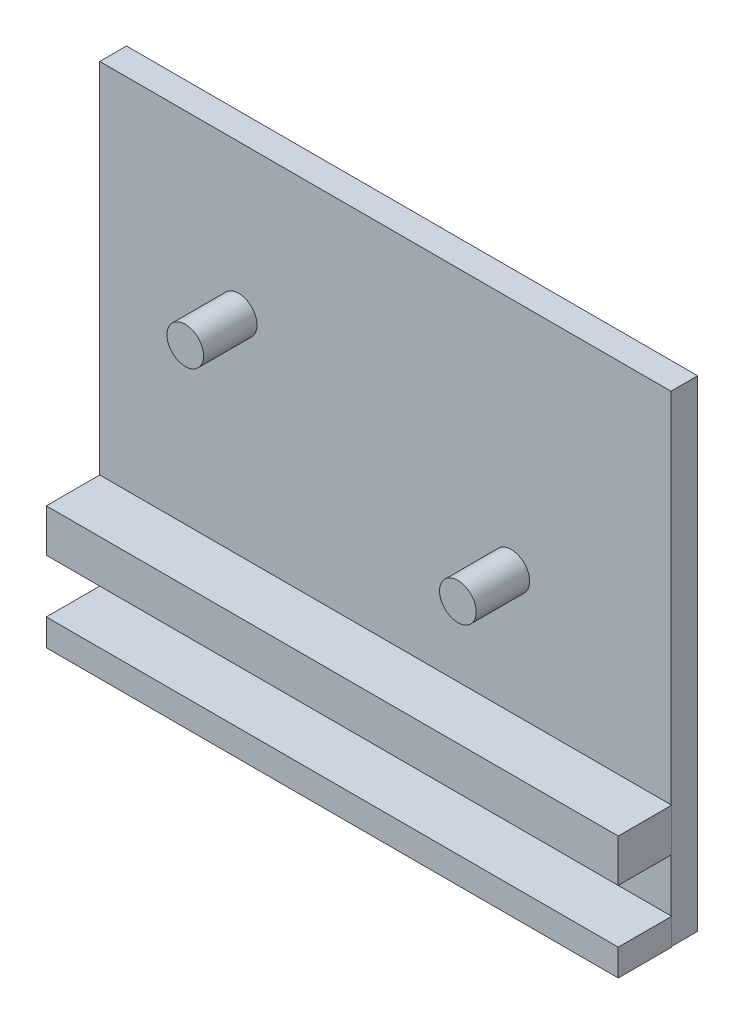
ISO-10303-21;
HEADER;
FILE_DESCRIPTION(('STEP AP214'),'2;1');
FILE_NAME('part.step','',(''),(''),'','','');
FILE_SCHEMA(('AUTOMOTIVE_DESIGN { 1 0 10303 214 1 1 1 1 }'));
ENDSEC;
DATA;
#1=APPLICATION_CONTEXT('core data for automotive mechanical design processes');
#2=APPLICATION_PROTOCOL_DEFINITION('international standard','automotive_design',2000,#1);
#3=PRODUCT_CONTEXT('',#1,'mechanical');
#4=PRODUCT('Part','Part','',(#3));
#5=PRODUCT_RELATED_PRODUCT_CATEGORY('part','',(#4));
#6=PRODUCT_DEFINITION_FORMATION('','',#4);
#7=PRODUCT_DEFINITION_CONTEXT('part definition',#1,'design');
#8=PRODUCT_DEFINITION('design','',#6,#7);
#9=PRODUCT_DEFINITION_SHAPE('','',#8);
#10=(LENGTH_UNIT() NAMED_UNIT(*) SI_UNIT(.MILLI.,.METRE.));
#11=(NAMED_UNIT(*) PLANE_ANGLE_UNIT() SI_UNIT($,.RADIAN.));
#12=(NAMED_UNIT(*) SI_UNIT($,.STERADIAN.) SOLID_ANGLE_UNIT());
#13=UNCERTAINTY_MEASURE_WITH_UNIT(LENGTH_MEASURE(1.E-05),#10,'distance_accuracy_value','');
#14=(GEOMETRIC_REPRESENTATION_CONTEXT(3) GLOBAL_UNCERTAINTY_ASSIGNED_CONTEXT((#13)) GLOBAL_UNIT_ASSIGNED_CONTEXT((#10,
#11,#12)) REPRESENTATION_CONTEXT('',''));
#15=CARTESIAN_POINT('',(0.,0.,0.));
#16=DIRECTION('',(0.,0.,1.));
#17=DIRECTION('',(1.,0.,0.));
#18=AXIS2_PLACEMENT_3D('',#15,#16,#17);
#19=CARTESIAN_POINT('',(0.,0.,0.));
#20=DIRECTION('',(0.,0.,-1.));
#21=DIRECTION('',(-1.,0.,0.));
#22=AXIS2_PLACEMENT_3D('',#19,#20,#21);
#23=PLANE('',#22);
#24=DIRECTION('',(1.,0.,0.));
#25=VECTOR('',#24,1.);
#26=CARTESIAN_POINT('',(-53.5,-38.,0.));
#27=LINE('',#26,#25);
#28=CARTESIAN_POINT('',(-53.5,-38.,0.));
#29=VERTEX_POINT('',#28);
#30=CARTESIAN_POINT('',(53.3667548614009,-38.,0.));
#31=VERTEX_POINT('',#30);
#32=EDGE_CURVE('E54',#29,#31,#27,.T.);
#33=ORIENTED_EDGE('',*,*,#32,.F.);
#34=DIRECTION('',(0.,1.,0.));
#35=VECTOR('',#34,1.);
#36=CARTESIAN_POINT('',(-53.5,37.,0.));
#37=LINE('',#36,#35);
#38=CARTESIAN_POINT('',(-53.5,-48.,0.));
#39=VERTEX_POINT('',#38);
#40=EDGE_CURVE('E154',#39,#29,#37,.T.);
#41=ORIENTED_EDGE('',*,*,#40,.F.);
#42=DIRECTION('',(-1.,0.,0.));
#43=VECTOR('',#42,1.);
#44=CARTESIAN_POINT('',(0.,-48.,0.));
#45=LINE('',#44,#43);
#46=CARTESIAN_POINT('',(53.3667548614009,-48.,0.));
#47=VERTEX_POINT('',#46);
#48=EDGE_CURVE('E11',#47,#39,#45,.T.);
#49=ORIENTED_EDGE('',*,*,#48,.F.);
#50=DIRECTION('',(0.,-1.,0.));
#51=VECTOR('',#50,1.);
#52=CARTESIAN_POINT('',(53.3667548614009,37.,0.));
#53=LINE('',#52,#51);
#54=EDGE_CURVE('E62',#31,#47,#53,.T.);
#55=ORIENTED_EDGE('',*,*,#54,.F.);
#56=EDGE_LOOP('',(#33,#41,#49,#55));
#57=FACE_BOUND('',#56,.T.);
#58=ADVANCED_FACE('F39',(#57),#23,.F.);
#59=CARTESIAN_POINT('',(23.5,-7.00000000000001,0.));
#60=DIRECTION('',(0.,0.,-1.));
#61=DIRECTION('',(-1.,0.,0.));
#62=AXIS2_PLACEMENT_3D('',#59,#60,#61);
#63=CIRCLE('',#62,3.42413986926529);
#64=CARTESIAN_POINT('',(20.0758601307347,-7.00000000000001,0.));
#65=VERTEX_POINT('',#64);
#66=EDGE_CURVE('E47',#65,#65,#63,.F.);
#67=ORIENTED_EDGE('',*,*,#66,.F.);
#68=EDGE_LOOP('',(#67));
#69=FACE_BOUND('',#68,.T.);
#70=CARTESIAN_POINT('',(-27.5,8.99999999999999,0.));
#71=DIRECTION('',(0.,0.,1.));
#72=DIRECTION('',(1.,0.,0.));
#73=AXIS2_PLACEMENT_3D('',#70,#71,#72);
#74=CIRCLE('',#73,3.42413986926528);
#75=CARTESIAN_POINT('',(-24.0758601307347,8.99999999999999,0.));
#76=VERTEX_POINT('',#75);
#77=EDGE_CURVE('E216',#76,#76,#74,.T.);
#78=ORIENTED_EDGE('',*,*,#77,.F.);
#79=EDGE_LOOP('',(#78));
#80=FACE_BOUND('',#79,.T.);
#81=DIRECTION('',(-1.,0.,0.));
#82=VECTOR('',#81,1.);
#83=CARTESIAN_POINT('',(-53.5,-30.,0.));
#84=LINE('',#83,#82);
#85=CARTESIAN_POINT('',(53.3667548614009,-30.,0.));
#86=VERTEX_POINT('',#85);
#87=CARTESIAN_POINT('',(-53.5,-30.,0.));
#88=VERTEX_POINT('',#87);
#89=EDGE_CURVE('E235',#86,#88,#84,.T.);
#90=ORIENTED_EDGE('',*,*,#89,.F.);
#91=CARTESIAN_POINT('',(53.3667548614009,37.,0.));
#92=VERTEX_POINT('',#91);
#93=EDGE_CURVE('E192',#92,#86,#53,.T.);
#94=ORIENTED_EDGE('',*,*,#93,.F.);
#95=DIRECTION('',(1.,0.,0.));
#96=VECTOR('',#95,1.);
#97=CARTESIAN_POINT('',(53.3667548614009,37.,0.));
#98=LINE('',#97,#96);
#99=CARTESIAN_POINT('',(-53.5,37.,0.));
#100=VERTEX_POINT('',#99);
#101=EDGE_CURVE('E200',#100,#92,#98,.T.);
#102=ORIENTED_EDGE('',*,*,#101,.F.);
#103=EDGE_CURVE('E187',#88,#100,#37,.T.);
#104=ORIENTED_EDGE('',*,*,#103,.F.);
#105=EDGE_LOOP('',(#90,#94,#102,#104));
#106=FACE_BOUND('',#105,.T.);
#107=ADVANCED_FACE('F226',(#69,#80,#106),#23,.F.);
#108=CARTESIAN_POINT('',(-27.5,8.99999999999999,10.));
#109=DIRECTION('',(0.,0.,-1.));
#110=DIRECTION('',(-1.,0.,0.));
#111=AXIS2_PLACEMENT_3D('',#108,#109,#110);
#112=CYLINDRICAL_SURFACE('',#111,3.42413986926528);
#113=CARTESIAN_POINT('',(-27.5,8.99999999999999,10.));
#114=DIRECTION('',(0.,0.,1.));
#115=DIRECTION('',(1.,0.,0.));
#116=AXIS2_PLACEMENT_3D('',#113,#114,#115);
#117=CIRCLE('',#116,3.42413986926528);
#118=CARTESIAN_POINT('',(-24.0758601307347,8.99999999999999,10.));
#119=VERTEX_POINT('',#118);
#120=EDGE_CURVE('E217',#119,#119,#117,.T.);
#121=ORIENTED_EDGE('',*,*,#120,.F.);
#122=EDGE_LOOP('',(#121));
#123=FACE_BOUND('',#122,.T.);
#124=ORIENTED_EDGE('',*,*,#77,.T.);
#125=EDGE_LOOP('',(#124));
#126=FACE_BOUND('',#125,.T.);
#127=ADVANCED_FACE('F41',(#123,#126),#112,.T.);
#128=CARTESIAN_POINT('',(-27.5,8.99999999999999,10.));
#129=DIRECTION('',(0.,0.,1.));
#130=DIRECTION('',(1.,0.,0.));
#131=AXIS2_PLACEMENT_3D('',#128,#129,#130);
#132=PLANE('',#131);
#133=ORIENTED_EDGE('',*,*,#120,.T.);
#134=EDGE_LOOP('',(#133));
#135=FACE_BOUND('',#134,.T.);
#136=ADVANCED_FACE('F289',(#135),#132,.T.);
#137=CARTESIAN_POINT('',(-53.5,37.,-5.));
#138=DIRECTION('',(1.,0.,0.));
#139=DIRECTION('',(0.,1.,0.));
#140=AXIS2_PLACEMENT_3D('',#137,#138,#139);
#141=PLANE('',#140);
#142=DIRECTION('',(0.,0.,1.));
#143=VECTOR('',#142,1.);
#144=CARTESIAN_POINT('',(-53.5,-53.,-5.));
#145=LINE('',#144,#143);
#146=CARTESIAN_POINT('',(-53.5,-53.,-5.));
#147=VERTEX_POINT('',#146);
#148=CARTESIAN_POINT('',(-53.5,-53.,10.));
#149=VERTEX_POINT('',#148);
#150=EDGE_CURVE('E198',#147,#149,#145,.T.);
#151=ORIENTED_EDGE('',*,*,#150,.T.);
#152=DIRECTION('',(0.,-1.,0.));
#153=VECTOR('',#152,1.);
#154=CARTESIAN_POINT('',(-53.5,-53.,10.));
#155=LINE('',#154,#153);
#156=CARTESIAN_POINT('',(-53.5,-48.,10.));
#157=VERTEX_POINT('',#156);
#158=EDGE_CURVE('E163',#157,#149,#155,.T.);
#159=ORIENTED_EDGE('',*,*,#158,.F.);
#160=DIRECTION('',(0.,0.,-1.));
#161=VECTOR('',#160,1.);
#162=CARTESIAN_POINT('',(-53.5,-48.,10.));
#163=LINE('',#162,#161);
#164=EDGE_CURVE('E172',#157,#39,#163,.T.);
#165=ORIENTED_EDGE('',*,*,#164,.T.);
#166=ORIENTED_EDGE('',*,*,#40,.T.);
#167=DIRECTION('',(0.,0.,-1.));
#168=VECTOR('',#167,1.);
#169=CARTESIAN_POINT('',(-53.5,-38.,10.));
#170=LINE('',#169,#168);
#171=CARTESIAN_POINT('',(-53.5,-38.,10.));
#172=VERTEX_POINT('',#171);
#173=EDGE_CURVE('E134',#172,#29,#170,.T.);
#174=ORIENTED_EDGE('',*,*,#173,.F.);
#175=DIRECTION('',(0.,-1.,0.));
#176=VECTOR('',#175,1.);
#177=CARTESIAN_POINT('',(-53.5,-30.,10.));
#178=LINE('',#177,#176);
#179=CARTESIAN_POINT('',(-53.5,-30.,10.));
#180=VERTEX_POINT('',#179);
#181=EDGE_CURVE('E140',#180,#172,#178,.T.);
#182=ORIENTED_EDGE('',*,*,#181,.F.);
#183=DIRECTION('',(0.,0.,-1.));
#184=VECTOR('',#183,1.);
#185=CARTESIAN_POINT('',(-53.5,-30.,10.));
#186=LINE('',#185,#184);
#187=EDGE_CURVE('E249',#180,#88,#186,.T.);
#188=ORIENTED_EDGE('',*,*,#187,.T.);
#189=ORIENTED_EDGE('',*,*,#103,.T.);
#190=DIRECTION('',(0.,0.,1.));
#191=VECTOR('',#190,1.);
#192=CARTESIAN_POINT('',(-53.5,37.,-5.));
#193=LINE('',#192,#191);
#194=CARTESIAN_POINT('',(-53.5,37.,-5.));
#195=VERTEX_POINT('',#194);
#196=EDGE_CURVE('E213',#195,#100,#193,.T.);
#197=ORIENTED_EDGE('',*,*,#196,.F.);
#198=DIRECTION('',(0.,1.,0.));
#199=VECTOR('',#198,1.);
#200=CARTESIAN_POINT('',(-53.5,37.,-5.));
#201=LINE('',#200,#199);
#202=EDGE_CURVE('E188',#147,#195,#201,.T.);
#203=ORIENTED_EDGE('',*,*,#202,.F.);
#204=EDGE_LOOP('',(#151,#159,#165,#166,#174,#182,#188,#189,#197,#203));
#205=FACE_BOUND('',#204,.T.);
#206=ADVANCED_FACE('F152',(#205),#141,.F.);
#207=CARTESIAN_POINT('',(53.3667548614009,37.,-5.));
#208=DIRECTION('',(0.,-1.,0.));
#209=DIRECTION('',(0.,0.,-1.));
#210=AXIS2_PLACEMENT_3D('',#207,#208,#209);
#211=PLANE('',#210);
#212=ORIENTED_EDGE('',*,*,#101,.T.);
#213=DIRECTION('',(0.,0.,1.));
#214=VECTOR('',#213,1.);
#215=CARTESIAN_POINT('',(53.3667548614009,37.,-5.));
#216=LINE('',#215,#214);
#217=CARTESIAN_POINT('',(53.3667548614009,37.,-5.));
#218=VERTEX_POINT('',#217);
#219=EDGE_CURVE('E210',#218,#92,#216,.T.);
#220=ORIENTED_EDGE('',*,*,#219,.F.);
#221=DIRECTION('',(1.,0.,0.));
#222=VECTOR('',#221,1.);
#223=CARTESIAN_POINT('',(53.3667548614009,37.,-5.));
#224=LINE('',#223,#222);
#225=EDGE_CURVE('E191',#195,#218,#224,.T.);
#226=ORIENTED_EDGE('',*,*,#225,.F.);
#227=ORIENTED_EDGE('',*,*,#196,.T.);
#228=EDGE_LOOP('',(#212,#220,#226,#227));
#229=FACE_BOUND('',#228,.T.);
#230=ADVANCED_FACE('F246',(#229),#211,.F.);
#231=CARTESIAN_POINT('',(53.3667548614009,37.,-5.));
#232=DIRECTION('',(-1.,0.,0.));
#233=DIRECTION('',(0.,-1.,0.));
#234=AXIS2_PLACEMENT_3D('',#231,#232,#233);
#235=PLANE('',#234);
#236=ORIENTED_EDGE('',*,*,#93,.T.);
#237=EDGE_CURVE('E205',#86,#31,#53,.T.);
#238=ORIENTED_EDGE('',*,*,#237,.T.);
#239=ORIENTED_EDGE('',*,*,#54,.T.);
#240=CARTESIAN_POINT('',(53.3667548614009,-53.,0.));
#241=VERTEX_POINT('',#240);
#242=EDGE_CURVE('E202',#47,#241,#53,.T.);
#243=ORIENTED_EDGE('',*,*,#242,.T.);
#244=DIRECTION('',(0.,0.,1.));
#245=VECTOR('',#244,1.);
#246=CARTESIAN_POINT('',(53.3667548614009,-53.,-5.));
#247=LINE('',#246,#245);
#248=CARTESIAN_POINT('',(53.3667548614009,-53.,-5.));
#249=VERTEX_POINT('',#248);
#250=EDGE_CURVE('E207',#249,#241,#247,.T.);
#251=ORIENTED_EDGE('',*,*,#250,.F.);
#252=DIRECTION('',(0.,-1.,0.));
#253=VECTOR('',#252,1.);
#254=CARTESIAN_POINT('',(53.3667548614009,37.,-5.));
#255=LINE('',#254,#253);
#256=EDGE_CURVE('E194',#218,#249,#255,.T.);
#257=ORIENTED_EDGE('',*,*,#256,.F.);
#258=ORIENTED_EDGE('',*,*,#219,.T.);
#259=EDGE_LOOP('',(#236,#238,#239,#243,#251,#257,#258));
#260=FACE_BOUND('',#259,.T.);
#261=ADVANCED_FACE('F241',(#260),#235,.F.);
#262=CARTESIAN_POINT('',(53.3667548614009,-53.,-5.));
#263=DIRECTION('',(0.,1.,0.));
#264=DIRECTION('',(0.,0.,1.));
#265=AXIS2_PLACEMENT_3D('',#262,#263,#264);
#266=PLANE('',#265);
#267=ORIENTED_EDGE('',*,*,#250,.T.);
#268=DIRECTION('',(1.,0.,0.));
#269=VECTOR('',#268,1.);
#270=CARTESIAN_POINT('',(-53.5,-53.,0.));
#271=LINE('',#270,#269);
#272=CARTESIAN_POINT('',(53.5,-53.,0.));
#273=VERTEX_POINT('',#272);
#274=EDGE_CURVE('E155',#241,#273,#271,.T.);
#275=ORIENTED_EDGE('',*,*,#274,.T.);
#276=DIRECTION('',(0.,0.,-1.));
#277=VECTOR('',#276,1.);
#278=CARTESIAN_POINT('',(53.5,-53.,10.));
#279=LINE('',#278,#277);
#280=CARTESIAN_POINT('',(53.5,-53.,10.));
#281=VERTEX_POINT('',#280);
#282=EDGE_CURVE('E181',#281,#273,#279,.T.);
#283=ORIENTED_EDGE('',*,*,#282,.F.);
#284=DIRECTION('',(1.,0.,0.));
#285=VECTOR('',#284,1.);
#286=CARTESIAN_POINT('',(-53.5,-53.,10.));
#287=LINE('',#286,#285);
#288=EDGE_CURVE('E166',#149,#281,#287,.T.);
#289=ORIENTED_EDGE('',*,*,#288,.F.);
#290=ORIENTED_EDGE('',*,*,#150,.F.);
#291=DIRECTION('',(-1.,0.,0.));
#292=VECTOR('',#291,1.);
#293=CARTESIAN_POINT('',(53.3667548614009,-53.,-5.));
#294=LINE('',#293,#292);
#295=EDGE_CURVE('E196',#249,#147,#294,.T.);
#296=ORIENTED_EDGE('',*,*,#295,.F.);
#297=EDGE_LOOP('',(#267,#275,#283,#289,#290,#296));
#298=FACE_BOUND('',#297,.T.);
#299=ADVANCED_FACE('F280',(#298),#266,.F.);
#300=CARTESIAN_POINT('',(0.,0.,-5.));
#301=DIRECTION('',(0.,0.,-1.));
#302=DIRECTION('',(-1.,0.,0.));
#303=AXIS2_PLACEMENT_3D('',#300,#301,#302);
#304=PLANE('',#303);
#305=ORIENTED_EDGE('',*,*,#202,.T.);
#306=ORIENTED_EDGE('',*,*,#225,.T.);
#307=ORIENTED_EDGE('',*,*,#256,.T.);
#308=ORIENTED_EDGE('',*,*,#295,.T.);
#309=EDGE_LOOP('',(#305,#306,#307,#308));
#310=FACE_BOUND('',#309,.T.);
#311=ADVANCED_FACE('F278',(#310),#304,.T.);
#312=CARTESIAN_POINT('',(23.5,-7.00000000000001,10.));
#313=DIRECTION('',(0.,0.,-1.));
#314=DIRECTION('',(-1.,0.,0.));
#315=AXIS2_PLACEMENT_3D('',#312,#313,#314);
#316=CYLINDRICAL_SURFACE('',#315,3.42413986926529);
#317=CARTESIAN_POINT('',(23.5,-7.00000000000001,10.));
#318=DIRECTION('',(0.,0.,1.));
#319=DIRECTION('',(1.,0.,0.));
#320=AXIS2_PLACEMENT_3D('',#317,#318,#319);
#321=CIRCLE('',#320,3.42413986926529);
#322=CARTESIAN_POINT('',(26.9241398692653,-7.00000000000001,10.));
#323=VERTEX_POINT('',#322);
#324=EDGE_CURVE('E184',#323,#323,#321,.T.);
#325=ORIENTED_EDGE('',*,*,#324,.F.);
#326=EDGE_LOOP('',(#325));
#327=FACE_BOUND('',#326,.T.);
#328=ORIENTED_EDGE('',*,*,#66,.T.);
#329=EDGE_LOOP('',(#328));
#330=FACE_BOUND('',#329,.T.);
#331=ADVANCED_FACE('F224',(#327,#330),#316,.T.);
#332=CARTESIAN_POINT('',(23.5,-7.00000000000001,10.));
#333=DIRECTION('',(0.,0.,1.));
#334=DIRECTION('',(1.,0.,0.));
#335=AXIS2_PLACEMENT_3D('',#332,#333,#334);
#336=PLANE('',#335);
#337=ORIENTED_EDGE('',*,*,#324,.T.);
#338=EDGE_LOOP('',(#337));
#339=FACE_BOUND('',#338,.T.);
#340=ADVANCED_FACE('F411',(#339),#336,.T.);
#341=CARTESIAN_POINT('',(0.,0.,0.));
#342=DIRECTION('',(0.,0.,-1.));
#343=DIRECTION('',(-1.,0.,0.));
#344=AXIS2_PLACEMENT_3D('',#341,#342,#343);
#345=PLANE('',#344);
#346=ORIENTED_EDGE('',*,*,#242,.F.);
#347=DIRECTION('',(-1.,0.,0.));
#348=VECTOR('',#347,1.);
#349=CARTESIAN_POINT('',(-53.5,-48.,0.));
#350=LINE('',#349,#348);
#351=CARTESIAN_POINT('',(53.5,-48.,0.));
#352=VERTEX_POINT('',#351);
#353=EDGE_CURVE('E167',#352,#47,#350,.T.);
#354=ORIENTED_EDGE('',*,*,#353,.F.);
#355=DIRECTION('',(0.,1.,0.));
#356=VECTOR('',#355,1.);
#357=CARTESIAN_POINT('',(53.5,-53.,0.));
#358=LINE('',#357,#356);
#359=EDGE_CURVE('E157',#273,#352,#358,.T.);
#360=ORIENTED_EDGE('',*,*,#359,.F.);
#361=ORIENTED_EDGE('',*,*,#274,.F.);
#362=EDGE_LOOP('',(#346,#354,#360,#361));
#363=FACE_BOUND('',#362,.T.);
#364=ADVANCED_FACE('F401',(#363),#345,.T.);
#365=CARTESIAN_POINT('',(53.5,-53.,10.));
#366=DIRECTION('',(-1.,0.,0.));
#367=DIRECTION('',(0.,0.,1.));
#368=AXIS2_PLACEMENT_3D('',#365,#366,#367);
#369=PLANE('',#368);
#370=ORIENTED_EDGE('',*,*,#359,.T.);
#371=DIRECTION('',(0.,0.,-1.));
#372=VECTOR('',#371,1.);
#373=CARTESIAN_POINT('',(53.5,-48.,10.));
#374=LINE('',#373,#372);
#375=CARTESIAN_POINT('',(53.5,-48.,10.));
#376=VERTEX_POINT('',#375);
#377=EDGE_CURVE('E178',#376,#352,#374,.T.);
#378=ORIENTED_EDGE('',*,*,#377,.F.);
#379=DIRECTION('',(0.,1.,0.));
#380=VECTOR('',#379,1.);
#381=CARTESIAN_POINT('',(53.5,-53.,10.));
#382=LINE('',#381,#380);
#383=EDGE_CURVE('E169',#281,#376,#382,.T.);
#384=ORIENTED_EDGE('',*,*,#383,.F.);
#385=ORIENTED_EDGE('',*,*,#282,.T.);
#386=EDGE_LOOP('',(#370,#378,#384,#385));
#387=FACE_BOUND('',#386,.T.);
#388=ADVANCED_FACE('F391',(#387),#369,.F.);
#389=CARTESIAN_POINT('',(-53.5,-48.,10.));
#390=DIRECTION('',(0.,-1.,0.));
#391=DIRECTION('',(1.,0.,0.));
#392=AXIS2_PLACEMENT_3D('',#389,#390,#391);
#393=PLANE('',#392);
#394=ORIENTED_EDGE('',*,*,#353,.T.);
#395=ORIENTED_EDGE('',*,*,#48,.T.);
#396=ORIENTED_EDGE('',*,*,#164,.F.);
#397=DIRECTION('',(-1.,0.,0.));
#398=VECTOR('',#397,1.);
#399=CARTESIAN_POINT('',(-53.5,-48.,10.));
#400=LINE('',#399,#398);
#401=EDGE_CURVE('E171',#376,#157,#400,.T.);
#402=ORIENTED_EDGE('',*,*,#401,.F.);
#403=ORIENTED_EDGE('',*,*,#377,.T.);
#404=EDGE_LOOP('',(#394,#395,#396,#402,#403));
#405=FACE_BOUND('',#404,.T.);
#406=ADVANCED_FACE('F382',(#405),#393,.F.);
#407=CARTESIAN_POINT('',(0.,0.,10.));
#408=DIRECTION('',(0.,0.,-1.));
#409=DIRECTION('',(-1.,0.,0.));
#410=AXIS2_PLACEMENT_3D('',#407,#408,#409);
#411=PLANE('',#410);
#412=ORIENTED_EDGE('',*,*,#158,.T.);
#413=ORIENTED_EDGE('',*,*,#288,.T.);
#414=ORIENTED_EDGE('',*,*,#383,.T.);
#415=ORIENTED_EDGE('',*,*,#401,.T.);
#416=EDGE_LOOP('',(#412,#413,#414,#415));
#417=FACE_BOUND('',#416,.T.);
#418=ADVANCED_FACE('F335',(#417),#411,.F.);
#419=CARTESIAN_POINT('',(0.,0.,0.));
#420=DIRECTION('',(0.,0.,1.));
#421=DIRECTION('',(1.,0.,0.));
#422=AXIS2_PLACEMENT_3D('',#419,#420,#421);
#423=PLANE('',#422);
#424=CARTESIAN_POINT('',(53.5,-38.,0.));
#425=VERTEX_POINT('',#424);
#426=EDGE_CURVE('E255',#31,#425,#27,.T.);
#427=ORIENTED_EDGE('',*,*,#426,.F.);
#428=ORIENTED_EDGE('',*,*,#237,.F.);
#429=CARTESIAN_POINT('',(53.5,-30.,0.));
#430=VERTEX_POINT('',#429);
#431=EDGE_CURVE('E149',#430,#86,#84,.T.);
#432=ORIENTED_EDGE('',*,*,#431,.F.);
#433=DIRECTION('',(0.,1.,0.));
#434=VECTOR('',#433,1.);
#435=CARTESIAN_POINT('',(53.5,-30.,0.));
#436=LINE('',#435,#434);
#437=EDGE_CURVE('E239',#425,#430,#436,.T.);
#438=ORIENTED_EDGE('',*,*,#437,.F.);
#439=EDGE_LOOP('',(#427,#428,#432,#438));
#440=FACE_BOUND('',#439,.T.);
#441=ADVANCED_FACE('F331',(#440),#423,.F.);
#442=CARTESIAN_POINT('',(-53.5,-38.,10.));
#443=DIRECTION('',(0.,1.,0.));
#444=DIRECTION('',(-1.,0.,0.));
#445=AXIS2_PLACEMENT_3D('',#442,#443,#444);
#446=PLANE('',#445);
#447=ORIENTED_EDGE('',*,*,#32,.T.);
#448=ORIENTED_EDGE('',*,*,#426,.T.);
#449=DIRECTION('',(0.,0.,-1.));
#450=VECTOR('',#449,1.);
#451=CARTESIAN_POINT('',(53.5,-38.,10.));
#452=LINE('',#451,#450);
#453=CARTESIAN_POINT('',(53.5,-38.,10.));
#454=VERTEX_POINT('',#453);
#455=EDGE_CURVE('E136',#454,#425,#452,.T.);
#456=ORIENTED_EDGE('',*,*,#455,.F.);
#457=DIRECTION('',(1.,0.,0.));
#458=VECTOR('',#457,1.);
#459=CARTESIAN_POINT('',(-53.5,-38.,10.));
#460=LINE('',#459,#458);
#461=EDGE_CURVE('E130',#172,#454,#460,.T.);
#462=ORIENTED_EDGE('',*,*,#461,.F.);
#463=ORIENTED_EDGE('',*,*,#173,.T.);
#464=EDGE_LOOP('',(#447,#448,#456,#462,#463));
#465=FACE_BOUND('',#464,.T.);
#466=ADVANCED_FACE('F132',(#465),#446,.F.);
#467=CARTESIAN_POINT('',(53.5,-30.,10.));
#468=DIRECTION('',(-1.,0.,0.));
#469=DIRECTION('',(0.,0.,1.));
#470=AXIS2_PLACEMENT_3D('',#467,#468,#469);
#471=PLANE('',#470);
#472=ORIENTED_EDGE('',*,*,#437,.T.);
#473=DIRECTION('',(0.,0.,-1.));
#474=VECTOR('',#473,1.);
#475=CARTESIAN_POINT('',(53.5,-30.,10.));
#476=LINE('',#475,#474);
#477=CARTESIAN_POINT('',(53.5,-30.,10.));
#478=VERTEX_POINT('',#477);
#479=EDGE_CURVE('E159',#478,#430,#476,.T.);
#480=ORIENTED_EDGE('',*,*,#479,.F.);
#481=DIRECTION('',(0.,1.,0.));
#482=VECTOR('',#481,1.);
#483=CARTESIAN_POINT('',(53.5,-30.,10.));
#484=LINE('',#483,#482);
#485=EDGE_CURVE('E139',#454,#478,#484,.T.);
#486=ORIENTED_EDGE('',*,*,#485,.F.);
#487=ORIENTED_EDGE('',*,*,#455,.T.);
#488=EDGE_LOOP('',(#472,#480,#486,#487));
#489=FACE_BOUND('',#488,.T.);
#490=ADVANCED_FACE('F259',(#489),#471,.F.);
#491=CARTESIAN_POINT('',(-53.5,-30.,10.));
#492=DIRECTION('',(0.,-1.,0.));
#493=DIRECTION('',(0.,0.,-1.));
#494=AXIS2_PLACEMENT_3D('',#491,#492,#493);
#495=PLANE('',#494);
#496=ORIENTED_EDGE('',*,*,#431,.T.);
#497=ORIENTED_EDGE('',*,*,#89,.T.);
#498=ORIENTED_EDGE('',*,*,#187,.F.);
#499=DIRECTION('',(-1.,0.,0.));
#500=VECTOR('',#499,1.);
#501=CARTESIAN_POINT('',(-53.5,-30.,10.));
#502=LINE('',#501,#500);
#503=EDGE_CURVE('E145',#478,#180,#502,.T.);
#504=ORIENTED_EDGE('',*,*,#503,.F.);
#505=ORIENTED_EDGE('',*,*,#479,.T.);
#506=EDGE_LOOP('',(#496,#497,#498,#504,#505));
#507=FACE_BOUND('',#506,.T.);
#508=ADVANCED_FACE('F262',(#507),#495,.F.);
#509=CARTESIAN_POINT('',(0.,0.,10.));
#510=DIRECTION('',(0.,0.,1.));
#511=DIRECTION('',(1.,0.,0.));
#512=AXIS2_PLACEMENT_3D('',#509,#510,#511);
#513=PLANE('',#512);
#514=ORIENTED_EDGE('',*,*,#181,.T.);
#515=ORIENTED_EDGE('',*,*,#461,.T.);
#516=ORIENTED_EDGE('',*,*,#485,.T.);
#517=ORIENTED_EDGE('',*,*,#503,.T.);
#518=EDGE_LOOP('',(#514,#515,#516,#517));
#519=FACE_BOUND('',#518,.T.);
#520=ADVANCED_FACE('F143',(#519),#513,.T.);
#521=CLOSED_SHELL('',(#58,#107,#127,#136,#206,#230,#261,#299,#311,#331,#340,#364,#388,#406,#418,
#441,#466,#490,#508,#520));
#522=MANIFOLD_SOLID_BREP('B2',#521);
#523=ADVANCED_BREP_SHAPE_REPRESENTATION('',(#18,#522),#14);
#524=SHAPE_DEFINITION_REPRESENTATION(#9,#523);
ENDSEC;
END-ISO-10303-21;
